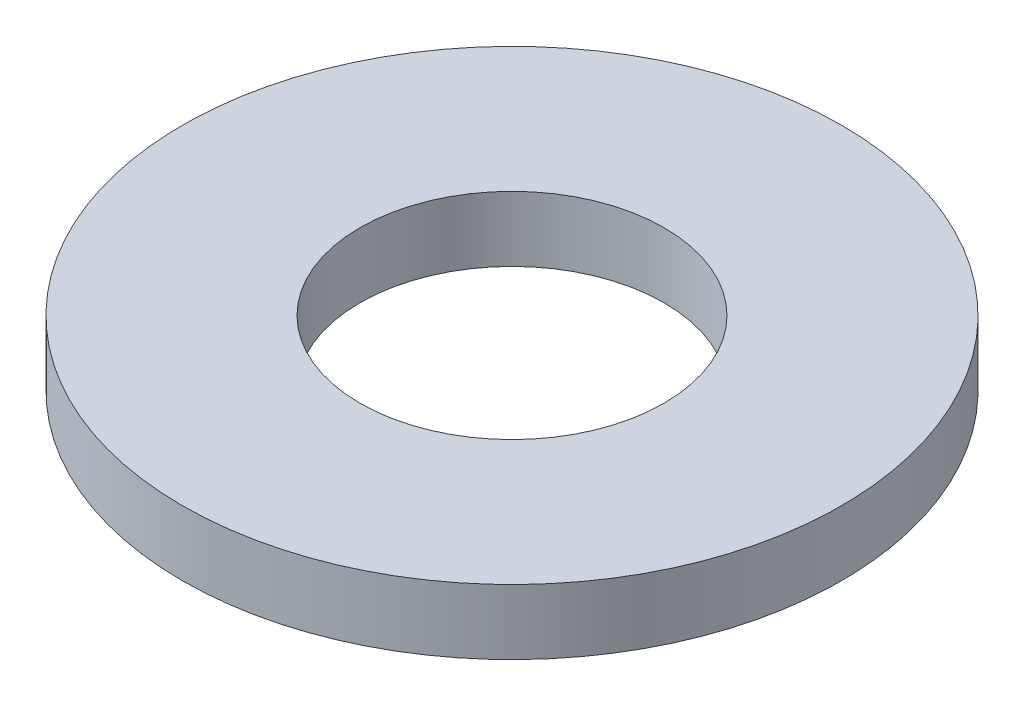
ISO-10303-21;
HEADER;
FILE_DESCRIPTION(('STEP AP214'),'2;1');
FILE_NAME('part.step','',(''),(''),'','','');
FILE_SCHEMA(('AUTOMOTIVE_DESIGN { 1 0 10303 214 1 1 1 1 }'));
ENDSEC;
DATA;
#1=APPLICATION_CONTEXT('core data for automotive mechanical design processes');
#2=APPLICATION_PROTOCOL_DEFINITION('international standard','automotive_design',2000,#1);
#3=PRODUCT_CONTEXT('',#1,'mechanical');
#4=PRODUCT('Part','Part','',(#3));
#5=PRODUCT_RELATED_PRODUCT_CATEGORY('part','',(#4));
#6=PRODUCT_DEFINITION_FORMATION('','',#4);
#7=PRODUCT_DEFINITION_CONTEXT('part definition',#1,'design');
#8=PRODUCT_DEFINITION('design','',#6,#7);
#9=PRODUCT_DEFINITION_SHAPE('','',#8);
#10=(LENGTH_UNIT() NAMED_UNIT(*) SI_UNIT(.MILLI.,.METRE.));
#11=(NAMED_UNIT(*) PLANE_ANGLE_UNIT() SI_UNIT($,.RADIAN.));
#12=(NAMED_UNIT(*) SI_UNIT($,.STERADIAN.) SOLID_ANGLE_UNIT());
#13=UNCERTAINTY_MEASURE_WITH_UNIT(LENGTH_MEASURE(1.E-05),#10,'distance_accuracy_value','');
#14=(GEOMETRIC_REPRESENTATION_CONTEXT(3) GLOBAL_UNCERTAINTY_ASSIGNED_CONTEXT((#13)) GLOBAL_UNIT_ASSIGNED_CONTEXT((#10,
#11,#12)) REPRESENTATION_CONTEXT('',''));
#15=CARTESIAN_POINT('',(0.,0.,0.));
#16=DIRECTION('',(0.,0.,1.));
#17=DIRECTION('',(1.,0.,0.));
#18=AXIS2_PLACEMENT_3D('',#15,#16,#17);
#19=CARTESIAN_POINT('',(0.,0.9398,0.));
#20=DIRECTION('',(0.,1.,0.));
#21=DIRECTION('',(0.,0.,1.));
#22=AXIS2_PLACEMENT_3D('',#19,#20,#21);
#23=PLANE('',#22);
#24=CARTESIAN_POINT('',(0.,0.9398,0.));
#25=DIRECTION('',(0.,-1.,0.));
#26=DIRECTION('',(0.,0.,-1.));
#27=AXIS2_PLACEMENT_3D('',#24,#25,#26);
#28=CIRCLE('',#27,2.1971);
#29=CARTESIAN_POINT('',(0.,0.9398,-2.1971));
#30=VERTEX_POINT('',#29);
#31=EDGE_CURVE('E25',#30,#30,#28,.T.);
#32=ORIENTED_EDGE('',*,*,#31,.T.);
#33=EDGE_LOOP('',(#32));
#34=FACE_BOUND('',#33,.T.);
#35=CARTESIAN_POINT('',(0.,0.9398,0.));
#36=DIRECTION('',(0.,-1.,0.));
#37=DIRECTION('',(0.,0.,-1.));
#38=AXIS2_PLACEMENT_3D('',#35,#36,#37);
#39=CIRCLE('',#38,4.7625);
#40=CARTESIAN_POINT('',(0.,0.9398,-4.7625));
#41=VERTEX_POINT('',#40);
#42=EDGE_CURVE('E16',#41,#41,#39,.T.);
#43=ORIENTED_EDGE('',*,*,#42,.F.);
#44=EDGE_LOOP('',(#43));
#45=FACE_BOUND('',#44,.T.);
#46=ADVANCED_FACE('F12',(#34,#45),#23,.T.);
#47=CARTESIAN_POINT('',(0.,0.9398,0.));
#48=DIRECTION('',(0.,-1.,0.));
#49=DIRECTION('',(0.,0.,-1.));
#50=AXIS2_PLACEMENT_3D('',#47,#48,#49);
#51=CYLINDRICAL_SURFACE('',#50,4.7625);
#52=ORIENTED_EDGE('',*,*,#42,.T.);
#53=EDGE_LOOP('',(#52));
#54=FACE_BOUND('',#53,.T.);
#55=CARTESIAN_POINT('',(0.,0.,0.));
#56=DIRECTION('',(0.,-1.,0.));
#57=DIRECTION('',(0.,0.,-1.));
#58=AXIS2_PLACEMENT_3D('',#55,#56,#57);
#59=CIRCLE('',#58,4.7625);
#60=CARTESIAN_POINT('',(0.,0.,-4.7625));
#61=VERTEX_POINT('',#60);
#62=EDGE_CURVE('E20',#61,#61,#59,.F.);
#63=ORIENTED_EDGE('',*,*,#62,.T.);
#64=EDGE_LOOP('',(#63));
#65=FACE_BOUND('',#64,.T.);
#66=ADVANCED_FACE('F33',(#54,#65),#51,.T.);
#67=CARTESIAN_POINT('',(0.,0.9398,0.));
#68=DIRECTION('',(0.,-1.,0.));
#69=DIRECTION('',(0.,0.,-1.));
#70=AXIS2_PLACEMENT_3D('',#67,#68,#69);
#71=CYLINDRICAL_SURFACE('',#70,2.1971);
#72=CARTESIAN_POINT('',(0.,0.,0.));
#73=DIRECTION('',(0.,-1.,0.));
#74=DIRECTION('',(0.,0.,-1.));
#75=AXIS2_PLACEMENT_3D('',#72,#73,#74);
#76=CIRCLE('',#75,2.1971);
#77=CARTESIAN_POINT('',(0.,0.,-2.1971));
#78=VERTEX_POINT('',#77);
#79=EDGE_CURVE('E8',#78,#78,#76,.T.);
#80=ORIENTED_EDGE('',*,*,#79,.T.);
#81=EDGE_LOOP('',(#80));
#82=FACE_BOUND('',#81,.T.);
#83=ORIENTED_EDGE('',*,*,#31,.F.);
#84=EDGE_LOOP('',(#83));
#85=FACE_BOUND('',#84,.T.);
#86=ADVANCED_FACE('F42',(#82,#85),#71,.F.);
#87=CARTESIAN_POINT('',(0.,0.,0.));
#88=DIRECTION('',(0.,1.,0.));
#89=DIRECTION('',(0.,0.,1.));
#90=AXIS2_PLACEMENT_3D('',#87,#88,#89);
#91=PLANE('',#90);
#92=ORIENTED_EDGE('',*,*,#79,.F.);
#93=EDGE_LOOP('',(#92));
#94=FACE_BOUND('',#93,.T.);
#95=ORIENTED_EDGE('',*,*,#62,.F.);
#96=EDGE_LOOP('',(#95));
#97=FACE_BOUND('',#96,.T.);
#98=ADVANCED_FACE('F14',(#94,#97),#91,.F.);
#99=CLOSED_SHELL('',(#46,#66,#86,#98));
#100=MANIFOLD_SOLID_BREP('B1',#99);
#101=ADVANCED_BREP_SHAPE_REPRESENTATION('',(#18,#100),#14);
#102=SHAPE_DEFINITION_REPRESENTATION(#9,#101);
ENDSEC;
END-ISO-10303-21;
